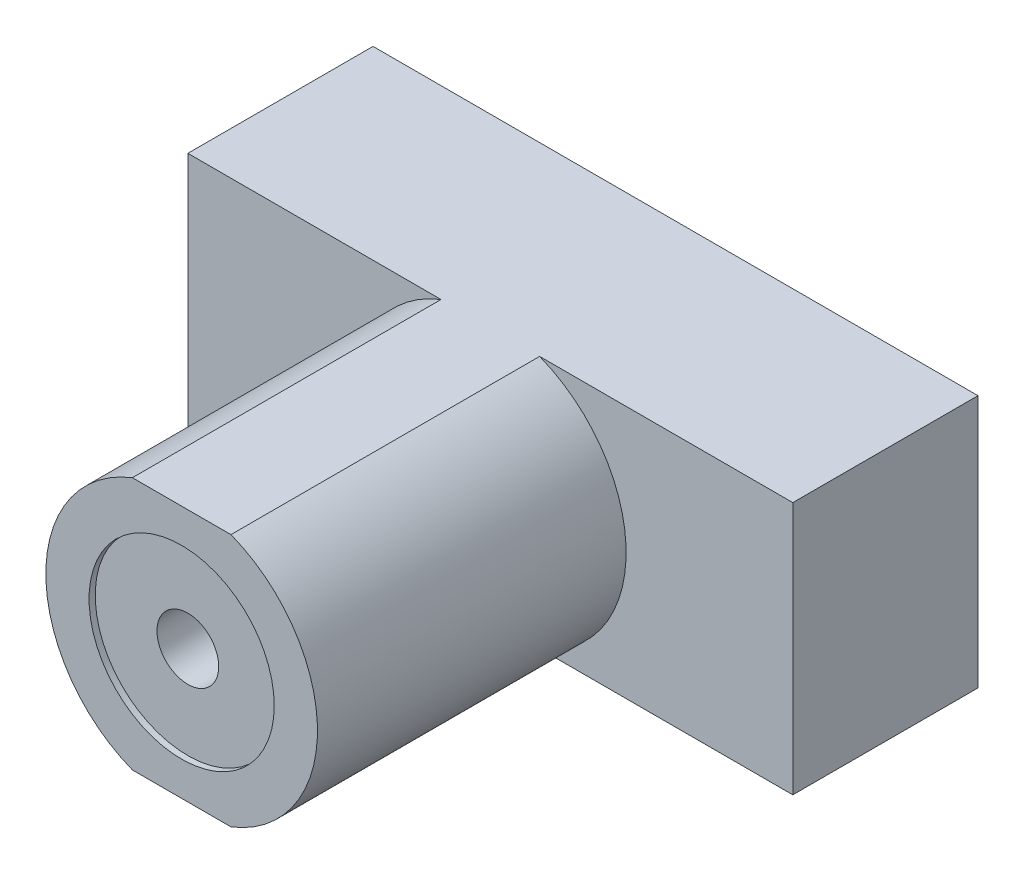
ISO-10303-21;
HEADER;
FILE_DESCRIPTION(('STEP AP214'),'2;1');
FILE_NAME('part.step','',(''),(''),'','','');
FILE_SCHEMA(('AUTOMOTIVE_DESIGN { 1 0 10303 214 1 1 1 1 }'));
ENDSEC;
DATA;
#1=APPLICATION_CONTEXT('core data for automotive mechanical design processes');
#2=APPLICATION_PROTOCOL_DEFINITION('international standard','automotive_design',2000,#1);
#3=PRODUCT_CONTEXT('',#1,'mechanical');
#4=PRODUCT('Part','Part','',(#3));
#5=PRODUCT_RELATED_PRODUCT_CATEGORY('part','',(#4));
#6=PRODUCT_DEFINITION_FORMATION('','',#4);
#7=PRODUCT_DEFINITION_CONTEXT('part definition',#1,'design');
#8=PRODUCT_DEFINITION('design','',#6,#7);
#9=PRODUCT_DEFINITION_SHAPE('','',#8);
#10=(LENGTH_UNIT() NAMED_UNIT(*) SI_UNIT(.MILLI.,.METRE.));
#11=(NAMED_UNIT(*) PLANE_ANGLE_UNIT() SI_UNIT($,.RADIAN.));
#12=(NAMED_UNIT(*) SI_UNIT($,.STERADIAN.) SOLID_ANGLE_UNIT());
#13=UNCERTAINTY_MEASURE_WITH_UNIT(LENGTH_MEASURE(1.E-05),#10,'distance_accuracy_value','');
#14=(GEOMETRIC_REPRESENTATION_CONTEXT(3) GLOBAL_UNCERTAINTY_ASSIGNED_CONTEXT((#13)) GLOBAL_UNIT_ASSIGNED_CONTEXT((#10,
#11,#12)) REPRESENTATION_CONTEXT('',''));
#15=CARTESIAN_POINT('',(0.,0.,0.));
#16=DIRECTION('',(0.,0.,1.));
#17=DIRECTION('',(1.,0.,0.));
#18=AXIS2_PLACEMENT_3D('',#15,#16,#17);
#19=CARTESIAN_POINT('',(-4.9,-1.4,8.));
#20=DIRECTION('',(1.,0.,0.));
#21=DIRECTION('',(0.,0.,-1.));
#22=AXIS2_PLACEMENT_3D('',#19,#20,#21);
#23=PLANE('',#22);
#24=DIRECTION('',(0.,-1.,0.));
#25=VECTOR('',#24,1.);
#26=CARTESIAN_POINT('',(-4.9,-1.4,3.));
#27=LINE('',#26,#25);
#28=CARTESIAN_POINT('',(-4.9,-1.4,3.));
#29=VERTEX_POINT('',#28);
#30=CARTESIAN_POINT('',(-4.9,-5.5,3.));
#31=VERTEX_POINT('',#30);
#32=EDGE_CURVE('E106',#29,#31,#27,.T.);
#33=ORIENTED_EDGE('',*,*,#32,.F.);
#34=DIRECTION('',(0.,0.,-1.));
#35=VECTOR('',#34,1.);
#36=CARTESIAN_POINT('',(-4.9,-1.4,8.));
#37=LINE('',#36,#35);
#38=CARTESIAN_POINT('',(-4.9,-1.4,0.));
#39=VERTEX_POINT('',#38);
#40=EDGE_CURVE('E119',#29,#39,#37,.T.);
#41=ORIENTED_EDGE('',*,*,#40,.T.);
#42=DIRECTION('',(0.,-1.,0.));
#43=VECTOR('',#42,1.);
#44=CARTESIAN_POINT('',(-4.9,-1.4,0.));
#45=LINE('',#44,#43);
#46=CARTESIAN_POINT('',(-4.9,-5.5,0.));
#47=VERTEX_POINT('',#46);
#48=EDGE_CURVE('E150',#39,#47,#45,.T.);
#49=ORIENTED_EDGE('',*,*,#48,.T.);
#50=DIRECTION('',(0.,0.,-1.));
#51=VECTOR('',#50,1.);
#52=CARTESIAN_POINT('',(-4.9,-5.5,8.));
#53=LINE('',#52,#51);
#54=EDGE_CURVE('E11',#31,#47,#53,.T.);
#55=ORIENTED_EDGE('',*,*,#54,.F.);
#56=EDGE_LOOP('',(#33,#41,#49,#55));
#57=FACE_BOUND('',#56,.T.);
#58=ADVANCED_FACE('F36',(#57),#23,.F.);
#59=CARTESIAN_POINT('',(4.9,-5.5,8.));
#60=DIRECTION('',(-1.,0.,0.));
#61=DIRECTION('',(0.,0.,1.));
#62=AXIS2_PLACEMENT_3D('',#59,#60,#61);
#63=PLANE('',#62);
#64=DIRECTION('',(0.,1.,0.));
#65=VECTOR('',#64,1.);
#66=CARTESIAN_POINT('',(4.9,-5.5,3.));
#67=LINE('',#66,#65);
#68=CARTESIAN_POINT('',(4.9,-5.5,3.));
#69=VERTEX_POINT('',#68);
#70=CARTESIAN_POINT('',(4.9,-1.4,3.));
#71=VERTEX_POINT('',#70);
#72=EDGE_CURVE('E139',#69,#71,#67,.T.);
#73=ORIENTED_EDGE('',*,*,#72,.F.);
#74=DIRECTION('',(0.,0.,-1.));
#75=VECTOR('',#74,1.);
#76=CARTESIAN_POINT('',(4.9,-5.5,8.));
#77=LINE('',#76,#75);
#78=CARTESIAN_POINT('',(4.9,-5.5,0.));
#79=VERTEX_POINT('',#78);
#80=EDGE_CURVE('E44',#69,#79,#77,.T.);
#81=ORIENTED_EDGE('',*,*,#80,.T.);
#82=DIRECTION('',(0.,1.,0.));
#83=VECTOR('',#82,1.);
#84=CARTESIAN_POINT('',(4.9,-5.5,0.));
#85=LINE('',#84,#83);
#86=CARTESIAN_POINT('',(4.9,-1.4,0.));
#87=VERTEX_POINT('',#86);
#88=EDGE_CURVE('E137',#79,#87,#85,.T.);
#89=ORIENTED_EDGE('',*,*,#88,.T.);
#90=DIRECTION('',(0.,0.,-1.));
#91=VECTOR('',#90,1.);
#92=CARTESIAN_POINT('',(4.9,-1.4,8.));
#93=LINE('',#92,#91);
#94=EDGE_CURVE('E122',#71,#87,#93,.T.);
#95=ORIENTED_EDGE('',*,*,#94,.F.);
#96=EDGE_LOOP('',(#73,#81,#89,#95));
#97=FACE_BOUND('',#96,.T.);
#98=ADVANCED_FACE('F134',(#97),#63,.F.);
#99=CARTESIAN_POINT('',(-4.9,-5.5,8.));
#100=DIRECTION('',(0.,1.,0.));
#101=DIRECTION('',(0.,0.,1.));
#102=AXIS2_PLACEMENT_3D('',#99,#100,#101);
#103=PLANE('',#102);
#104=DIRECTION('',(1.,0.,0.));
#105=VECTOR('',#104,1.);
#106=CARTESIAN_POINT('',(-4.9,-5.5,8.));
#107=LINE('',#106,#105);
#108=CARTESIAN_POINT('',(-0.798435971133567,-5.5,8.));
#109=VERTEX_POINT('',#108);
#110=CARTESIAN_POINT('',(0.79843597113357,-5.5,8.));
#111=VERTEX_POINT('',#110);
#112=EDGE_CURVE('E120',#109,#111,#107,.T.);
#113=ORIENTED_EDGE('',*,*,#112,.F.);
#114=DIRECTION('',(0.,0.,1.));
#115=VECTOR('',#114,1.);
#116=CARTESIAN_POINT('',(-0.798435971133567,-5.5,3.));
#117=LINE('',#116,#115);
#118=CARTESIAN_POINT('',(-0.798435971133567,-5.5,3.));
#119=VERTEX_POINT('',#118);
#120=EDGE_CURVE('E51',#119,#109,#117,.T.);
#121=ORIENTED_EDGE('',*,*,#120,.F.);
#122=DIRECTION('',(1.,0.,0.));
#123=VECTOR('',#122,1.);
#124=CARTESIAN_POINT('',(-4.9,-5.5,3.));
#125=LINE('',#124,#123);
#126=EDGE_CURVE('E175',#31,#119,#125,.T.);
#127=ORIENTED_EDGE('',*,*,#126,.F.);
#128=ORIENTED_EDGE('',*,*,#54,.T.);
#129=DIRECTION('',(1.,0.,0.));
#130=VECTOR('',#129,1.);
#131=CARTESIAN_POINT('',(-4.9,-5.5,0.));
#132=LINE('',#131,#130);
#133=EDGE_CURVE('E143',#47,#79,#132,.T.);
#134=ORIENTED_EDGE('',*,*,#133,.T.);
#135=ORIENTED_EDGE('',*,*,#80,.F.);
#136=DIRECTION('',(1.,0.,0.));
#137=VECTOR('',#136,1.);
#138=CARTESIAN_POINT('',(0.79843597113357,-5.5,3.));
#139=LINE('',#138,#137);
#140=CARTESIAN_POINT('',(0.79843597113357,-5.5,3.));
#141=VERTEX_POINT('',#140);
#142=EDGE_CURVE('E165',#141,#69,#139,.T.);
#143=ORIENTED_EDGE('',*,*,#142,.F.);
#144=DIRECTION('',(0.,0.,1.));
#145=VECTOR('',#144,1.);
#146=CARTESIAN_POINT('',(0.79843597113357,-5.5,3.));
#147=LINE('',#146,#145);
#148=EDGE_CURVE('E157',#141,#111,#147,.T.);
#149=ORIENTED_EDGE('',*,*,#148,.T.);
#150=EDGE_LOOP('',(#113,#121,#127,#128,#134,#135,#143,#149));
#151=FACE_BOUND('',#150,.T.);
#152=ADVANCED_FACE('F144',(#151),#103,.F.);
#153=CARTESIAN_POINT('',(4.9,-1.4,8.));
#154=DIRECTION('',(0.,-1.,0.));
#155=DIRECTION('',(0.,0.,-1.));
#156=AXIS2_PLACEMENT_3D('',#153,#154,#155);
#157=PLANE('',#156);
#158=DIRECTION('',(-1.,0.,0.));
#159=VECTOR('',#158,1.);
#160=CARTESIAN_POINT('',(-0.798435971133569,-1.4,3.));
#161=LINE('',#160,#159);
#162=CARTESIAN_POINT('',(-0.798435971133569,-1.4,3.));
#163=VERTEX_POINT('',#162);
#164=EDGE_CURVE('E115',#163,#29,#161,.T.);
#165=ORIENTED_EDGE('',*,*,#164,.F.);
#166=DIRECTION('',(0.,0.,1.));
#167=VECTOR('',#166,1.);
#168=CARTESIAN_POINT('',(-0.798435971133569,-1.4,3.));
#169=LINE('',#168,#167);
#170=CARTESIAN_POINT('',(-0.798435971133569,-1.4,8.));
#171=VERTEX_POINT('',#170);
#172=EDGE_CURVE('E101',#163,#171,#169,.T.);
#173=ORIENTED_EDGE('',*,*,#172,.T.);
#174=DIRECTION('',(-1.,0.,0.));
#175=VECTOR('',#174,1.);
#176=CARTESIAN_POINT('',(4.9,-1.4,8.));
#177=LINE('',#176,#175);
#178=CARTESIAN_POINT('',(0.798435971133569,-1.4,8.));
#179=VERTEX_POINT('',#178);
#180=EDGE_CURVE('E113',#179,#171,#177,.T.);
#181=ORIENTED_EDGE('',*,*,#180,.F.);
#182=DIRECTION('',(0.,0.,1.));
#183=VECTOR('',#182,1.);
#184=CARTESIAN_POINT('',(0.798435971133569,-1.4,3.));
#185=LINE('',#184,#183);
#186=CARTESIAN_POINT('',(0.798435971133569,-1.4,3.));
#187=VERTEX_POINT('',#186);
#188=EDGE_CURVE('E59',#187,#179,#185,.T.);
#189=ORIENTED_EDGE('',*,*,#188,.F.);
#190=DIRECTION('',(-1.,0.,0.));
#191=VECTOR('',#190,1.);
#192=CARTESIAN_POINT('',(4.9,-1.4,3.));
#193=LINE('',#192,#191);
#194=EDGE_CURVE('E160',#71,#187,#193,.T.);
#195=ORIENTED_EDGE('',*,*,#194,.F.);
#196=ORIENTED_EDGE('',*,*,#94,.T.);
#197=DIRECTION('',(-1.,0.,0.));
#198=VECTOR('',#197,1.);
#199=CARTESIAN_POINT('',(4.9,-1.4,0.));
#200=LINE('',#199,#198);
#201=EDGE_CURVE('E124',#87,#39,#200,.T.);
#202=ORIENTED_EDGE('',*,*,#201,.T.);
#203=ORIENTED_EDGE('',*,*,#40,.F.);
#204=EDGE_LOOP('',(#165,#173,#181,#189,#195,#196,#202,#203));
#205=FACE_BOUND('',#204,.T.);
#206=ADVANCED_FACE('F112',(#205),#157,.F.);
#207=CARTESIAN_POINT('',(-4.9,-5.5,8.));
#208=DIRECTION('',(0.,0.,1.));
#209=DIRECTION('',(1.,0.,0.));
#210=AXIS2_PLACEMENT_3D('',#207,#208,#209);
#211=PLANE('',#210);
#212=CARTESIAN_POINT('',(0.,-3.45,8.));
#213=DIRECTION('',(0.,0.,1.));
#214=DIRECTION('',(1.,0.,0.));
#215=AXIS2_PLACEMENT_3D('',#212,#213,#214);
#216=CIRCLE('',#215,1.5);
#217=CARTESIAN_POINT('',(1.5,-3.45,8.));
#218=VERTEX_POINT('',#217);
#219=EDGE_CURVE('E184',#218,#218,#216,.T.);
#220=ORIENTED_EDGE('',*,*,#219,.F.);
#221=EDGE_LOOP('',(#220));
#222=FACE_BOUND('',#221,.T.);
#223=CARTESIAN_POINT('',(0.,-3.45,8.));
#224=DIRECTION('',(0.,0.,-1.));
#225=DIRECTION('',(1.,0.,0.));
#226=AXIS2_PLACEMENT_3D('',#223,#224,#225);
#227=CIRCLE('',#226,2.2);
#228=EDGE_CURVE('E98',#109,#171,#227,.T.);
#229=ORIENTED_EDGE('',*,*,#228,.F.);
#230=ORIENTED_EDGE('',*,*,#112,.T.);
#231=CARTESIAN_POINT('',(0.,-3.45,8.));
#232=DIRECTION('',(0.,0.,-1.));
#233=DIRECTION('',(1.,0.,0.));
#234=AXIS2_PLACEMENT_3D('',#231,#232,#233);
#235=CIRCLE('',#234,2.2);
#236=EDGE_CURVE('E116',#179,#111,#235,.T.);
#237=ORIENTED_EDGE('',*,*,#236,.F.);
#238=ORIENTED_EDGE('',*,*,#180,.T.);
#239=EDGE_LOOP('',(#229,#230,#237,#238));
#240=FACE_BOUND('',#239,.T.);
#241=ADVANCED_FACE('F118',(#222,#240),#211,.T.);
#242=CARTESIAN_POINT('',(-4.9,-5.5,0.));
#243=DIRECTION('',(0.,0.,1.));
#244=DIRECTION('',(1.,0.,0.));
#245=AXIS2_PLACEMENT_3D('',#242,#243,#244);
#246=PLANE('',#245);
#247=ORIENTED_EDGE('',*,*,#48,.F.);
#248=ORIENTED_EDGE('',*,*,#201,.F.);
#249=ORIENTED_EDGE('',*,*,#88,.F.);
#250=ORIENTED_EDGE('',*,*,#133,.F.);
#251=EDGE_LOOP('',(#247,#248,#249,#250));
#252=FACE_BOUND('',#251,.T.);
#253=ADVANCED_FACE('F152',(#252),#246,.F.);
#254=CARTESIAN_POINT('',(0.,-3.45,3.));
#255=DIRECTION('',(0.,0.,1.));
#256=DIRECTION('',(1.,0.,0.));
#257=AXIS2_PLACEMENT_3D('',#254,#255,#256);
#258=CYLINDRICAL_SURFACE('',#257,2.2);
#259=ORIENTED_EDGE('',*,*,#236,.T.);
#260=ORIENTED_EDGE('',*,*,#148,.F.);
#261=CARTESIAN_POINT('',(0.,-3.45,3.));
#262=DIRECTION('',(0.,0.,-1.));
#263=DIRECTION('',(1.,0.,0.));
#264=AXIS2_PLACEMENT_3D('',#261,#262,#263);
#265=CIRCLE('',#264,2.2);
#266=EDGE_CURVE('E167',#187,#141,#265,.T.);
#267=ORIENTED_EDGE('',*,*,#266,.F.);
#268=ORIENTED_EDGE('',*,*,#188,.T.);
#269=EDGE_LOOP('',(#259,#260,#267,#268));
#270=FACE_BOUND('',#269,.T.);
#271=ADVANCED_FACE('F196',(#270),#258,.T.);
#272=CARTESIAN_POINT('',(0.,-3.45,3.));
#273=DIRECTION('',(0.,0.,1.));
#274=DIRECTION('',(1.,0.,0.));
#275=AXIS2_PLACEMENT_3D('',#272,#273,#274);
#276=PLANE('',#275);
#277=ORIENTED_EDGE('',*,*,#266,.T.);
#278=ORIENTED_EDGE('',*,*,#142,.T.);
#279=ORIENTED_EDGE('',*,*,#72,.T.);
#280=ORIENTED_EDGE('',*,*,#194,.T.);
#281=EDGE_LOOP('',(#277,#278,#279,#280));
#282=FACE_BOUND('',#281,.T.);
#283=ADVANCED_FACE('F209',(#282),#276,.T.);
#284=CARTESIAN_POINT('',(0.,-3.45,3.));
#285=DIRECTION('',(0.,0.,1.));
#286=DIRECTION('',(1.,0.,0.));
#287=AXIS2_PLACEMENT_3D('',#284,#285,#286);
#288=CYLINDRICAL_SURFACE('',#287,2.2);
#289=ORIENTED_EDGE('',*,*,#228,.T.);
#290=ORIENTED_EDGE('',*,*,#172,.F.);
#291=CARTESIAN_POINT('',(0.,-3.45,3.));
#292=DIRECTION('',(0.,0.,-1.));
#293=DIRECTION('',(1.,0.,0.));
#294=AXIS2_PLACEMENT_3D('',#291,#292,#293);
#295=CIRCLE('',#294,2.2);
#296=EDGE_CURVE('E173',#119,#163,#295,.T.);
#297=ORIENTED_EDGE('',*,*,#296,.F.);
#298=ORIENTED_EDGE('',*,*,#120,.T.);
#299=EDGE_LOOP('',(#289,#290,#297,#298));
#300=FACE_BOUND('',#299,.T.);
#301=ADVANCED_FACE('F100',(#300),#288,.T.);
#302=CARTESIAN_POINT('',(0.,-3.45,3.));
#303=DIRECTION('',(0.,0.,1.));
#304=DIRECTION('',(1.,0.,0.));
#305=AXIS2_PLACEMENT_3D('',#302,#303,#304);
#306=PLANE('',#305);
#307=ORIENTED_EDGE('',*,*,#32,.T.);
#308=ORIENTED_EDGE('',*,*,#126,.T.);
#309=ORIENTED_EDGE('',*,*,#296,.T.);
#310=ORIENTED_EDGE('',*,*,#164,.T.);
#311=EDGE_LOOP('',(#307,#308,#309,#310));
#312=FACE_BOUND('',#311,.T.);
#313=ADVANCED_FACE('F219',(#312),#306,.T.);
#314=CARTESIAN_POINT('',(0.,-3.45,7.9));
#315=DIRECTION('',(0.,0.,1.));
#316=DIRECTION('',(1.,0.,0.));
#317=AXIS2_PLACEMENT_3D('',#314,#315,#316);
#318=PLANE('',#317);
#319=CARTESIAN_POINT('',(0.,-3.45,7.9));
#320=DIRECTION('',(0.,0.,1.));
#321=DIRECTION('',(1.,0.,0.));
#322=AXIS2_PLACEMENT_3D('',#319,#320,#321);
#323=CIRCLE('',#322,1.5);
#324=CARTESIAN_POINT('',(1.5,-3.45,7.9));
#325=VERTEX_POINT('',#324);
#326=EDGE_CURVE('E181',#325,#325,#323,.T.);
#327=ORIENTED_EDGE('',*,*,#326,.T.);
#328=EDGE_LOOP('',(#327));
#329=FACE_BOUND('',#328,.T.);
#330=CARTESIAN_POINT('',(0.,-3.45,7.9));
#331=DIRECTION('',(0.,0.,1.));
#332=DIRECTION('',(1.,0.,0.));
#333=AXIS2_PLACEMENT_3D('',#330,#331,#332);
#334=CIRCLE('',#333,0.5);
#335=CARTESIAN_POINT('',(0.5,-3.45,7.9));
#336=VERTEX_POINT('',#335);
#337=EDGE_CURVE('E39',#336,#336,#334,.F.);
#338=ORIENTED_EDGE('',*,*,#337,.T.);
#339=EDGE_LOOP('',(#338));
#340=FACE_BOUND('',#339,.T.);
#341=ADVANCED_FACE('F222',(#329,#340),#318,.T.);
#342=CARTESIAN_POINT('',(0.,-3.45,7.9));
#343=DIRECTION('',(0.,0.,1.));
#344=DIRECTION('',(1.,0.,0.));
#345=AXIS2_PLACEMENT_3D('',#342,#343,#344);
#346=CYLINDRICAL_SURFACE('',#345,1.5);
#347=ORIENTED_EDGE('',*,*,#326,.F.);
#348=EDGE_LOOP('',(#347));
#349=FACE_BOUND('',#348,.T.);
#350=ORIENTED_EDGE('',*,*,#219,.T.);
#351=EDGE_LOOP('',(#350));
#352=FACE_BOUND('',#351,.T.);
#353=ADVANCED_FACE('F188',(#349,#352),#346,.F.);
#354=CARTESIAN_POINT('',(0.,-3.45,3.));
#355=DIRECTION('',(0.,0.,1.));
#356=DIRECTION('',(1.,0.,0.));
#357=AXIS2_PLACEMENT_3D('',#354,#355,#356);
#358=PLANE('',#357);
#359=CARTESIAN_POINT('',(0.,-3.45,3.));
#360=DIRECTION('',(0.,0.,1.));
#361=DIRECTION('',(1.,0.,0.));
#362=AXIS2_PLACEMENT_3D('',#359,#360,#361);
#363=CIRCLE('',#362,0.5);
#364=CARTESIAN_POINT('',(0.5,-3.45,3.));
#365=VERTEX_POINT('',#364);
#366=EDGE_CURVE('E107',#365,#365,#363,.T.);
#367=ORIENTED_EDGE('',*,*,#366,.T.);
#368=EDGE_LOOP('',(#367));
#369=FACE_BOUND('',#368,.T.);
#370=ADVANCED_FACE('F226',(#369),#358,.T.);
#371=CARTESIAN_POINT('',(0.,-3.45,3.));
#372=DIRECTION('',(0.,0.,1.));
#373=DIRECTION('',(1.,0.,0.));
#374=AXIS2_PLACEMENT_3D('',#371,#372,#373);
#375=CYLINDRICAL_SURFACE('',#374,0.5);
#376=ORIENTED_EDGE('',*,*,#366,.F.);
#377=EDGE_LOOP('',(#376));
#378=FACE_BOUND('',#377,.T.);
#379=ORIENTED_EDGE('',*,*,#337,.F.);
#380=EDGE_LOOP('',(#379));
#381=FACE_BOUND('',#380,.T.);
#382=ADVANCED_FACE('F223',(#378,#381),#375,.F.);
#383=CLOSED_SHELL('',(#58,#98,#152,#206,#241,#253,#271,#283,#301,#313,#341,#353,#370,#382));
#384=MANIFOLD_SOLID_BREP('B2',#383);
#385=ADVANCED_BREP_SHAPE_REPRESENTATION('',(#18,#384),#14);
#386=SHAPE_DEFINITION_REPRESENTATION(#9,#385);
ENDSEC;
END-ISO-10303-21;
